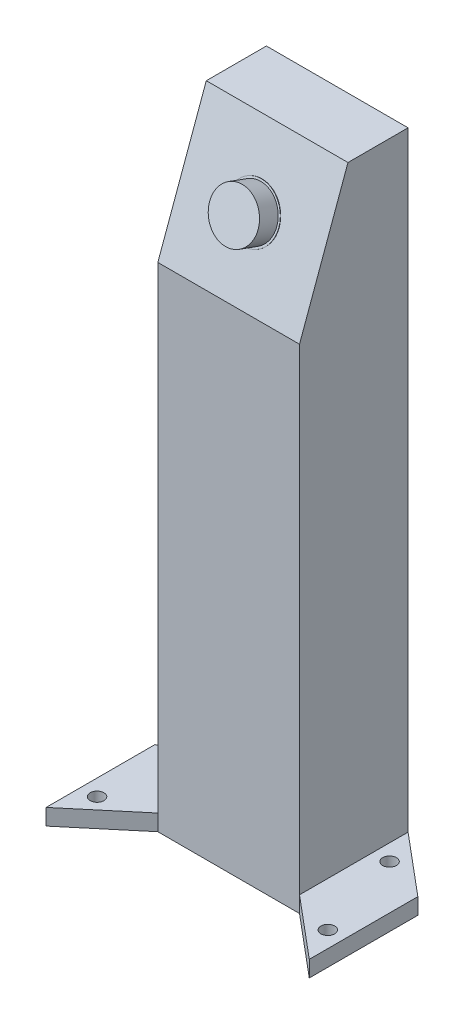
ISO-10303-21;
HEADER;
FILE_DESCRIPTION(('STEP AP214'),'2;1');
FILE_NAME('part.step','',(''),(''),'','','');
FILE_SCHEMA(('AUTOMOTIVE_DESIGN { 1 0 10303 214 1 1 1 1 }'));
ENDSEC;
DATA;
#1=APPLICATION_CONTEXT('core data for automotive mechanical design processes');
#2=APPLICATION_PROTOCOL_DEFINITION('international standard','automotive_design',2000,#1);
#3=PRODUCT_CONTEXT('',#1,'mechanical');
#4=PRODUCT('Part','Part','',(#3));
#5=PRODUCT_RELATED_PRODUCT_CATEGORY('part','',(#4));
#6=PRODUCT_DEFINITION_FORMATION('','',#4);
#7=PRODUCT_DEFINITION_CONTEXT('part definition',#1,'design');
#8=PRODUCT_DEFINITION('design','',#6,#7);
#9=PRODUCT_DEFINITION_SHAPE('','',#8);
#10=(LENGTH_UNIT() NAMED_UNIT(*) SI_UNIT(.MILLI.,.METRE.));
#11=(NAMED_UNIT(*) PLANE_ANGLE_UNIT() SI_UNIT($,.RADIAN.));
#12=(NAMED_UNIT(*) SI_UNIT($,.STERADIAN.) SOLID_ANGLE_UNIT());
#13=UNCERTAINTY_MEASURE_WITH_UNIT(LENGTH_MEASURE(1.E-05),#10,'distance_accuracy_value','');
#14=(GEOMETRIC_REPRESENTATION_CONTEXT(3) GLOBAL_UNCERTAINTY_ASSIGNED_CONTEXT((#13)) GLOBAL_UNIT_ASSIGNED_CONTEXT((#10,
#11,#12)) REPRESENTATION_CONTEXT('',''));
#15=CARTESIAN_POINT('',(0.,0.,0.));
#16=DIRECTION('',(0.,0.,1.));
#17=DIRECTION('',(1.,0.,0.));
#18=AXIS2_PLACEMENT_3D('',#15,#16,#17);
#19=CARTESIAN_POINT('',(35.,0.,0.));
#20=DIRECTION('',(1.,0.,0.));
#21=DIRECTION('',(0.,0.,-1.));
#22=AXIS2_PLACEMENT_3D('',#19,#20,#21);
#23=PLANE('',#22);
#24=DIRECTION('',(0.,-1.,0.));
#25=VECTOR('',#24,1.);
#26=CARTESIAN_POINT('',(35.,0.,0.));
#27=LINE('',#26,#25);
#28=CARTESIAN_POINT('',(35.,121.8,0.));
#29=VERTEX_POINT('',#28);
#30=CARTESIAN_POINT('',(35.,4.,0.));
#31=VERTEX_POINT('',#30);
#32=EDGE_CURVE('E200',#29,#31,#27,.T.);
#33=ORIENTED_EDGE('',*,*,#32,.T.);
#34=DIRECTION('',(0.,0.,-1.));
#35=VECTOR('',#34,1.);
#36=CARTESIAN_POINT('',(35.,4.,0.));
#37=LINE('',#36,#35);
#38=CARTESIAN_POINT('',(35.,4.,-26.82));
#39=VERTEX_POINT('',#38);
#40=EDGE_CURVE('E168',#31,#39,#37,.T.);
#41=ORIENTED_EDGE('',*,*,#40,.T.);
#42=DIRECTION('',(0.,1.,0.));
#43=VECTOR('',#42,1.);
#44=CARTESIAN_POINT('',(35.,0.,-26.82));
#45=LINE('',#44,#43);
#46=CARTESIAN_POINT('',(35.,154.689241727507,-26.82));
#47=VERTEX_POINT('',#46);
#48=EDGE_CURVE('E203',#39,#47,#45,.T.);
#49=ORIENTED_EDGE('',*,*,#48,.T.);
#50=DIRECTION('',(0.,0.,1.));
#51=VECTOR('',#50,1.);
#52=CARTESIAN_POINT('',(35.,154.689241727507,-26.82));
#53=LINE('',#52,#51);
#54=CARTESIAN_POINT('',(35.,154.689241727507,-11.9707050163983));
#55=VERTEX_POINT('',#54);
#56=EDGE_CURVE('E207',#47,#55,#53,.T.);
#57=ORIENTED_EDGE('',*,*,#56,.T.);
#58=DIRECTION('',(0.,-0.939692620785909,0.342020143325666));
#59=VECTOR('',#58,1.);
#60=CARTESIAN_POINT('',(35.,121.8,0.));
#61=LINE('',#60,#59);
#62=EDGE_CURVE('E209',#55,#29,#61,.T.);
#63=ORIENTED_EDGE('',*,*,#62,.T.);
#64=EDGE_LOOP('',(#33,#41,#49,#57,#63));
#65=FACE_BOUND('',#64,.T.);
#66=ADVANCED_FACE('F35',(#65),#23,.T.);
#67=CARTESIAN_POINT('',(35.,0.,0.));
#68=DIRECTION('',(0.,0.,-1.));
#69=DIRECTION('',(-1.,0.,0.));
#70=AXIS2_PLACEMENT_3D('',#67,#68,#69);
#71=PLANE('',#70);
#72=DIRECTION('',(0.,-1.,0.));
#73=VECTOR('',#72,1.);
#74=CARTESIAN_POINT('',(0.,0.,0.));
#75=LINE('',#74,#73);
#76=CARTESIAN_POINT('',(0.,121.8,0.));
#77=VERTEX_POINT('',#76);
#78=CARTESIAN_POINT('',(0.,4.,0.));
#79=VERTEX_POINT('',#78);
#80=EDGE_CURVE('E199',#77,#79,#75,.T.);
#81=ORIENTED_EDGE('',*,*,#80,.T.);
#82=DIRECTION('',(0.,-1.,0.));
#83=VECTOR('',#82,1.);
#84=CARTESIAN_POINT('',(0.,4.,0.));
#85=LINE('',#84,#83);
#86=CARTESIAN_POINT('',(0.,0.,0.));
#87=VERTEX_POINT('',#86);
#88=EDGE_CURVE('E137',#79,#87,#85,.T.);
#89=ORIENTED_EDGE('',*,*,#88,.T.);
#90=DIRECTION('',(-1.,0.,0.));
#91=VECTOR('',#90,1.);
#92=CARTESIAN_POINT('',(35.,0.,0.));
#93=LINE('',#92,#91);
#94=CARTESIAN_POINT('',(35.,0.,0.));
#95=VERTEX_POINT('',#94);
#96=EDGE_CURVE('E43',#95,#87,#93,.T.);
#97=ORIENTED_EDGE('',*,*,#96,.F.);
#98=DIRECTION('',(0.,-1.,0.));
#99=VECTOR('',#98,1.);
#100=CARTESIAN_POINT('',(35.,4.,0.));
#101=LINE('',#100,#99);
#102=EDGE_CURVE('E187',#31,#95,#101,.T.);
#103=ORIENTED_EDGE('',*,*,#102,.F.);
#104=ORIENTED_EDGE('',*,*,#32,.F.);
#105=DIRECTION('',(-1.,0.,0.));
#106=VECTOR('',#105,1.);
#107=CARTESIAN_POINT('',(35.,121.8,0.));
#108=LINE('',#107,#106);
#109=EDGE_CURVE('E211',#29,#77,#108,.T.);
#110=ORIENTED_EDGE('',*,*,#109,.T.);
#111=EDGE_LOOP('',(#81,#89,#97,#103,#104,#110));
#112=FACE_BOUND('',#111,.T.);
#113=ADVANCED_FACE('F37',(#112),#71,.F.);
#114=CARTESIAN_POINT('',(35.,0.,-11.9707050163983));
#115=DIRECTION('',(0.,1.,0.));
#116=DIRECTION('',(0.,0.,1.));
#117=AXIS2_PLACEMENT_3D('',#114,#115,#116);
#118=PLANE('',#117);
#119=ORIENTED_EDGE('',*,*,#96,.T.);
#120=DIRECTION('',(-0.766044443118982,0.,0.642787609686535));
#121=VECTOR('',#120,1.);
#122=CARTESIAN_POINT('',(-15.,0.,12.5864944676591));
#123=LINE('',#122,#121);
#124=CARTESIAN_POINT('',(-15.,0.,12.5864944676591));
#125=VERTEX_POINT('',#124);
#126=EDGE_CURVE('E149',#87,#125,#123,.T.);
#127=ORIENTED_EDGE('',*,*,#126,.T.);
#128=DIRECTION('',(0.,0.,-1.));
#129=VECTOR('',#128,1.);
#130=CARTESIAN_POINT('',(-15.,0.,-14.2335055323409));
#131=LINE('',#130,#129);
#132=CARTESIAN_POINT('',(-15.,0.,-14.2335055323409));
#133=VERTEX_POINT('',#132);
#134=EDGE_CURVE('E125',#125,#133,#131,.T.);
#135=ORIENTED_EDGE('',*,*,#134,.T.);
#136=DIRECTION('',(0.766044443118982,0.,-0.642787609686535));
#137=VECTOR('',#136,1.);
#138=CARTESIAN_POINT('',(0.,0.,-26.82));
#139=LINE('',#138,#137);
#140=CARTESIAN_POINT('',(0.,0.,-26.82));
#141=VERTEX_POINT('',#140);
#142=EDGE_CURVE('E139',#133,#141,#139,.T.);
#143=ORIENTED_EDGE('',*,*,#142,.T.);
#144=DIRECTION('',(-1.,0.,0.));
#145=VECTOR('',#144,1.);
#146=CARTESIAN_POINT('',(35.,0.,-26.82));
#147=LINE('',#146,#145);
#148=CARTESIAN_POINT('',(35.,0.,-26.82));
#149=VERTEX_POINT('',#148);
#150=EDGE_CURVE('E229',#149,#141,#147,.T.);
#151=ORIENTED_EDGE('',*,*,#150,.F.);
#152=DIRECTION('',(0.766044443118982,0.,0.642787609686535));
#153=VECTOR('',#152,1.);
#154=CARTESIAN_POINT('',(35.,0.,-26.82));
#155=LINE('',#154,#153);
#156=CARTESIAN_POINT('',(50.,0.,-14.2335055323409));
#157=VERTEX_POINT('',#156);
#158=EDGE_CURVE('E165',#149,#157,#155,.T.);
#159=ORIENTED_EDGE('',*,*,#158,.T.);
#160=DIRECTION('',(0.,0.,1.));
#161=VECTOR('',#160,1.);
#162=CARTESIAN_POINT('',(50.,0.,-14.2335055323409));
#163=LINE('',#162,#161);
#164=CARTESIAN_POINT('',(50.,0.,12.5864944676591));
#165=VERTEX_POINT('',#164);
#166=EDGE_CURVE('E182',#157,#165,#163,.T.);
#167=ORIENTED_EDGE('',*,*,#166,.T.);
#168=DIRECTION('',(-0.766044443118982,0.,-0.642787609686535));
#169=VECTOR('',#168,1.);
#170=CARTESIAN_POINT('',(50.,0.,12.5864944676591));
#171=LINE('',#170,#169);
#172=EDGE_CURVE('E171',#165,#95,#171,.T.);
#173=ORIENTED_EDGE('',*,*,#172,.T.);
#174=EDGE_LOOP('',(#119,#127,#135,#143,#151,#159,#167,#173));
#175=FACE_BOUND('',#174,.T.);
#176=CARTESIAN_POINT('',(39.,0.,-18.2419723179618));
#177=DIRECTION('',(0.,-1.,0.));
#178=DIRECTION('',(0.,0.,-1.));
#179=AXIS2_PLACEMENT_3D('',#176,#177,#178);
#180=CIRCLE('',#179,1.7);
#181=CARTESIAN_POINT('',(39.,0.,-19.9419723179618));
#182=VERTEX_POINT('',#181);
#183=EDGE_CURVE('E154',#182,#182,#180,.T.);
#184=ORIENTED_EDGE('',*,*,#183,.F.);
#185=EDGE_LOOP('',(#184));
#186=FACE_BOUND('',#185,.T.);
#187=CARTESIAN_POINT('',(46.,0.,4.00846678562087));
#188=DIRECTION('',(0.,-1.,0.));
#189=DIRECTION('',(0.,0.,-1.));
#190=AXIS2_PLACEMENT_3D('',#187,#188,#189);
#191=CIRCLE('',#190,1.7);
#192=CARTESIAN_POINT('',(46.,0.,2.30846678562087));
#193=VERTEX_POINT('',#192);
#194=EDGE_CURVE('E159',#193,#193,#191,.T.);
#195=ORIENTED_EDGE('',*,*,#194,.F.);
#196=EDGE_LOOP('',(#195));
#197=FACE_BOUND('',#196,.T.);
#198=CARTESIAN_POINT('',(-11.,0.,4.00846678562087));
#199=DIRECTION('',(0.,-1.,0.));
#200=DIRECTION('',(0.,0.,1.));
#201=AXIS2_PLACEMENT_3D('',#198,#199,#200);
#202=CIRCLE('',#201,1.7);
#203=CARTESIAN_POINT('',(-11.,0.,5.70846678562087));
#204=VERTEX_POINT('',#203);
#205=EDGE_CURVE('E459',#204,#204,#202,.T.);
#206=ORIENTED_EDGE('',*,*,#205,.F.);
#207=EDGE_LOOP('',(#206));
#208=FACE_BOUND('',#207,.T.);
#209=CARTESIAN_POINT('',(-4.,0.,-18.2419723179618));
#210=DIRECTION('',(0.,-1.,0.));
#211=DIRECTION('',(0.,0.,1.));
#212=AXIS2_PLACEMENT_3D('',#209,#210,#211);
#213=CIRCLE('',#212,1.7);
#214=CARTESIAN_POINT('',(-4.,0.,-16.5419723179618));
#215=VERTEX_POINT('',#214);
#216=EDGE_CURVE('E144',#215,#215,#213,.T.);
#217=ORIENTED_EDGE('',*,*,#216,.F.);
#218=EDGE_LOOP('',(#217));
#219=FACE_BOUND('',#218,.T.);
#220=ADVANCED_FACE('F278',(#175,#186,#197,#208,#219),#118,.F.);
#221=CARTESIAN_POINT('',(35.,0.,-26.82));
#222=DIRECTION('',(0.,0.,1.));
#223=DIRECTION('',(1.,0.,0.));
#224=AXIS2_PLACEMENT_3D('',#221,#222,#223);
#225=PLANE('',#224);
#226=DIRECTION('',(0.,1.,0.));
#227=VECTOR('',#226,1.);
#228=CARTESIAN_POINT('',(0.,0.,-26.82));
#229=LINE('',#228,#227);
#230=CARTESIAN_POINT('',(0.,4.,-26.82));
#231=VERTEX_POINT('',#230);
#232=EDGE_CURVE('E215',#141,#231,#229,.T.);
#233=ORIENTED_EDGE('',*,*,#232,.T.);
#234=CARTESIAN_POINT('',(0.,154.689241727507,-26.82));
#235=VERTEX_POINT('',#234);
#236=EDGE_CURVE('E214',#231,#235,#229,.T.);
#237=ORIENTED_EDGE('',*,*,#236,.T.);
#238=DIRECTION('',(-1.,0.,0.));
#239=VECTOR('',#238,1.);
#240=CARTESIAN_POINT('',(35.,154.689241727507,-26.82));
#241=LINE('',#240,#239);
#242=EDGE_CURVE('E226',#47,#235,#241,.T.);
#243=ORIENTED_EDGE('',*,*,#242,.F.);
#244=ORIENTED_EDGE('',*,*,#48,.F.);
#245=EDGE_CURVE('E205',#149,#39,#45,.T.);
#246=ORIENTED_EDGE('',*,*,#245,.F.);
#247=ORIENTED_EDGE('',*,*,#150,.T.);
#248=EDGE_LOOP('',(#233,#237,#243,#244,#246,#247));
#249=FACE_BOUND('',#248,.T.);
#250=ADVANCED_FACE('F271',(#249),#225,.F.);
#251=CARTESIAN_POINT('',(35.,154.689241727507,-26.82));
#252=DIRECTION('',(0.,-1.,0.));
#253=DIRECTION('',(0.,0.,-1.));
#254=AXIS2_PLACEMENT_3D('',#251,#252,#253);
#255=PLANE('',#254);
#256=DIRECTION('',(0.,0.,1.));
#257=VECTOR('',#256,1.);
#258=CARTESIAN_POINT('',(0.,154.689241727507,-26.82));
#259=LINE('',#258,#257);
#260=CARTESIAN_POINT('',(0.,154.689241727507,-11.9707050163983));
#261=VERTEX_POINT('',#260);
#262=EDGE_CURVE('E218',#235,#261,#259,.T.);
#263=ORIENTED_EDGE('',*,*,#262,.T.);
#264=DIRECTION('',(-1.,0.,0.));
#265=VECTOR('',#264,1.);
#266=CARTESIAN_POINT('',(35.,154.689241727507,-11.9707050163983));
#267=LINE('',#266,#265);
#268=EDGE_CURVE('E223',#55,#261,#267,.T.);
#269=ORIENTED_EDGE('',*,*,#268,.F.);
#270=ORIENTED_EDGE('',*,*,#56,.F.);
#271=ORIENTED_EDGE('',*,*,#242,.T.);
#272=EDGE_LOOP('',(#263,#269,#270,#271));
#273=FACE_BOUND('',#272,.T.);
#274=ADVANCED_FACE('F256',(#273),#255,.F.);
#275=CARTESIAN_POINT('',(35.,121.8,0.));
#276=DIRECTION('',(0.,-0.342020143325666,-0.93969262078591));
#277=DIRECTION('',(0.,0.93969262078591,-0.342020143325666));
#278=AXIS2_PLACEMENT_3D('',#275,#276,#277);
#279=PLANE('',#278);
#280=CARTESIAN_POINT('',(17.5,138.244620863753,-5.98535250819917));
#281=DIRECTION('',(0.,-0.342020143325666,-0.93969262078591));
#282=DIRECTION('',(0.,0.93969262078591,-0.342020143325666));
#283=AXIS2_PLACEMENT_3D('',#280,#281,#282);
#284=CIRCLE('',#283,6.50000000000001);
#285=CARTESIAN_POINT('',(17.5,144.352622898862,-8.208483439816));
#286=VERTEX_POINT('',#285);
#287=EDGE_CURVE('E11',#286,#286,#284,.F.);
#288=ORIENTED_EDGE('',*,*,#287,.F.);
#289=EDGE_LOOP('',(#288));
#290=FACE_BOUND('',#289,.T.);
#291=DIRECTION('',(0.,-0.939692620785909,0.342020143325666));
#292=VECTOR('',#291,1.);
#293=CARTESIAN_POINT('',(0.,121.8,0.));
#294=LINE('',#293,#292);
#295=EDGE_CURVE('E204',#261,#77,#294,.T.);
#296=ORIENTED_EDGE('',*,*,#295,.T.);
#297=ORIENTED_EDGE('',*,*,#109,.F.);
#298=ORIENTED_EDGE('',*,*,#62,.F.);
#299=ORIENTED_EDGE('',*,*,#268,.T.);
#300=EDGE_LOOP('',(#296,#297,#298,#299));
#301=FACE_BOUND('',#300,.T.);
#302=ADVANCED_FACE('F253',(#290,#301),#279,.F.);
#303=CARTESIAN_POINT('',(0.,0.,0.));
#304=DIRECTION('',(1.,0.,0.));
#305=DIRECTION('',(0.,0.,-1.));
#306=AXIS2_PLACEMENT_3D('',#303,#304,#305);
#307=PLANE('',#306);
#308=ORIENTED_EDGE('',*,*,#236,.F.);
#309=DIRECTION('',(0.,0.,1.));
#310=VECTOR('',#309,1.);
#311=CARTESIAN_POINT('',(0.,4.,0.));
#312=LINE('',#311,#310);
#313=EDGE_CURVE('E129',#231,#79,#312,.T.);
#314=ORIENTED_EDGE('',*,*,#313,.T.);
#315=ORIENTED_EDGE('',*,*,#80,.F.);
#316=ORIENTED_EDGE('',*,*,#295,.F.);
#317=ORIENTED_EDGE('',*,*,#262,.F.);
#318=EDGE_LOOP('',(#308,#314,#315,#316,#317));
#319=FACE_BOUND('',#318,.T.);
#320=ADVANCED_FACE('F249',(#319),#307,.F.);
#321=CARTESIAN_POINT('',(17.5,138.278822878086,-5.89138324612054));
#322=DIRECTION('',(0.,-0.342020143325666,-0.939692620785909));
#323=DIRECTION('',(0.,0.93969262078591,-0.342020143325666));
#324=AXIS2_PLACEMENT_3D('',#321,#322,#323);
#325=CYLINDRICAL_SURFACE('',#324,6.50000000000001);
#326=CARTESIAN_POINT('',(17.5,138.278822878086,-5.89138324612054));
#327=DIRECTION('',(0.,0.342020143325666,0.93969262078591));
#328=DIRECTION('',(0.,-0.93969262078591,0.342020143325666));
#329=AXIS2_PLACEMENT_3D('',#326,#327,#328);
#330=CIRCLE('',#329,6.50000000000001);
#331=CARTESIAN_POINT('',(17.5,132.170820842978,-3.66825231450371));
#332=VERTEX_POINT('',#331);
#333=EDGE_CURVE('E189',#332,#332,#330,.T.);
#334=ORIENTED_EDGE('',*,*,#333,.F.);
#335=EDGE_LOOP('',(#334));
#336=FACE_BOUND('',#335,.T.);
#337=ORIENTED_EDGE('',*,*,#287,.T.);
#338=EDGE_LOOP('',(#337));
#339=FACE_BOUND('',#338,.T.);
#340=ADVANCED_FACE('F243',(#336,#339),#325,.T.);
#341=CARTESIAN_POINT('',(17.5,138.278822878086,-5.89138324612054));
#342=DIRECTION('',(0.,0.342020143325666,0.93969262078591));
#343=DIRECTION('',(0.,-0.93969262078591,0.342020143325666));
#344=AXIS2_PLACEMENT_3D('',#341,#342,#343);
#345=PLANE('',#344);
#346=CARTESIAN_POINT('',(17.5,138.278822878086,-5.89138324612053));
#347=DIRECTION('',(0.,0.342020143325666,0.93969262078591));
#348=DIRECTION('',(0.,-0.93969262078591,0.342020143325666));
#349=AXIS2_PLACEMENT_3D('',#346,#347,#348);
#350=CIRCLE('',#349,6.00000000000001);
#351=CARTESIAN_POINT('',(17.5,132.640667153371,-3.83926238616653));
#352=VERTEX_POINT('',#351);
#353=EDGE_CURVE('E195',#352,#352,#350,.T.);
#354=ORIENTED_EDGE('',*,*,#353,.F.);
#355=EDGE_LOOP('',(#354));
#356=FACE_BOUND('',#355,.T.);
#357=ORIENTED_EDGE('',*,*,#333,.T.);
#358=EDGE_LOOP('',(#357));
#359=FACE_BOUND('',#358,.T.);
#360=ADVANCED_FACE('F239',(#356,#359),#345,.T.);
#361=CARTESIAN_POINT('',(17.5,139.954721580382,-1.28688940426957));
#362=DIRECTION('',(0.,0.342020143325666,0.93969262078591));
#363=DIRECTION('',(0.,-0.93969262078591,0.342020143325666));
#364=AXIS2_PLACEMENT_3D('',#361,#362,#363);
#365=PLANE('',#364);
#366=CARTESIAN_POINT('',(17.5,139.954721580382,-1.28688940426957));
#367=DIRECTION('',(0.,0.342020143325666,0.93969262078591));
#368=DIRECTION('',(0.,-0.93969262078591,0.342020143325666));
#369=AXIS2_PLACEMENT_3D('',#366,#367,#368);
#370=CIRCLE('',#369,6.00000000000001);
#371=CARTESIAN_POINT('',(17.5,134.316565855666,0.765231455684423));
#372=VERTEX_POINT('',#371);
#373=EDGE_CURVE('E196',#372,#372,#370,.T.);
#374=ORIENTED_EDGE('',*,*,#373,.T.);
#375=EDGE_LOOP('',(#374));
#376=FACE_BOUND('',#375,.T.);
#377=ADVANCED_FACE('F242',(#376),#365,.T.);
#378=CARTESIAN_POINT('',(17.5,139.954721580382,-1.28688940426957));
#379=DIRECTION('',(0.,-0.342020143325666,-0.93969262078591));
#380=DIRECTION('',(0.,0.93969262078591,-0.342020143325666));
#381=AXIS2_PLACEMENT_3D('',#378,#379,#380);
#382=CYLINDRICAL_SURFACE('',#381,6.00000000000001);
#383=ORIENTED_EDGE('',*,*,#353,.T.);
#384=EDGE_LOOP('',(#383));
#385=FACE_BOUND('',#384,.T.);
#386=ORIENTED_EDGE('',*,*,#373,.F.);
#387=EDGE_LOOP('',(#386));
#388=FACE_BOUND('',#387,.T.);
#389=ADVANCED_FACE('F236',(#385,#388),#382,.T.);
#390=CARTESIAN_POINT('',(50.,4.,12.5864944676591));
#391=DIRECTION('',(-0.642787609686535,0.,0.766044443118982));
#392=DIRECTION('',(0.766044443118982,0.,0.642787609686535));
#393=AXIS2_PLACEMENT_3D('',#390,#391,#392);
#394=PLANE('',#393);
#395=ORIENTED_EDGE('',*,*,#172,.F.);
#396=DIRECTION('',(0.,-1.,0.));
#397=VECTOR('',#396,1.);
#398=CARTESIAN_POINT('',(50.,4.,12.5864944676591));
#399=LINE('',#398,#397);
#400=CARTESIAN_POINT('',(50.,4.,12.5864944676591));
#401=VERTEX_POINT('',#400);
#402=EDGE_CURVE('E190',#401,#165,#399,.T.);
#403=ORIENTED_EDGE('',*,*,#402,.F.);
#404=DIRECTION('',(-0.766044443118982,0.,-0.642787609686535));
#405=VECTOR('',#404,1.);
#406=CARTESIAN_POINT('',(50.,4.,12.5864944676591));
#407=LINE('',#406,#405);
#408=EDGE_CURVE('E176',#401,#31,#407,.T.);
#409=ORIENTED_EDGE('',*,*,#408,.T.);
#410=ORIENTED_EDGE('',*,*,#102,.T.);
#411=EDGE_LOOP('',(#395,#403,#409,#410));
#412=FACE_BOUND('',#411,.T.);
#413=ADVANCED_FACE('F291',(#412),#394,.T.);
#414=CARTESIAN_POINT('',(50.,4.,-14.2335055323409));
#415=DIRECTION('',(1.,0.,0.));
#416=DIRECTION('',(0.,0.,-1.));
#417=AXIS2_PLACEMENT_3D('',#414,#415,#416);
#418=PLANE('',#417);
#419=ORIENTED_EDGE('',*,*,#166,.F.);
#420=DIRECTION('',(0.,-1.,0.));
#421=VECTOR('',#420,1.);
#422=CARTESIAN_POINT('',(50.,4.,-14.2335055323409));
#423=LINE('',#422,#421);
#424=CARTESIAN_POINT('',(50.,4.,-14.2335055323409));
#425=VERTEX_POINT('',#424);
#426=EDGE_CURVE('E179',#425,#157,#423,.T.);
#427=ORIENTED_EDGE('',*,*,#426,.F.);
#428=DIRECTION('',(0.,0.,1.));
#429=VECTOR('',#428,1.);
#430=CARTESIAN_POINT('',(50.,4.,-14.2335055323409));
#431=LINE('',#430,#429);
#432=EDGE_CURVE('E173',#425,#401,#431,.T.);
#433=ORIENTED_EDGE('',*,*,#432,.T.);
#434=ORIENTED_EDGE('',*,*,#402,.T.);
#435=EDGE_LOOP('',(#419,#427,#433,#434));
#436=FACE_BOUND('',#435,.T.);
#437=ADVANCED_FACE('F293',(#436),#418,.T.);
#438=CARTESIAN_POINT('',(35.,4.,-26.82));
#439=DIRECTION('',(0.642787609686535,0.,-0.766044443118982));
#440=DIRECTION('',(-0.766044443118982,0.,-0.642787609686535));
#441=AXIS2_PLACEMENT_3D('',#438,#439,#440);
#442=PLANE('',#441);
#443=ORIENTED_EDGE('',*,*,#158,.F.);
#444=ORIENTED_EDGE('',*,*,#245,.T.);
#445=DIRECTION('',(0.766044443118982,0.,0.642787609686535));
#446=VECTOR('',#445,1.);
#447=CARTESIAN_POINT('',(35.,4.,-26.82));
#448=LINE('',#447,#446);
#449=EDGE_CURVE('E58',#39,#425,#448,.T.);
#450=ORIENTED_EDGE('',*,*,#449,.T.);
#451=ORIENTED_EDGE('',*,*,#426,.T.);
#452=EDGE_LOOP('',(#443,#444,#450,#451));
#453=FACE_BOUND('',#452,.T.);
#454=ADVANCED_FACE('F288',(#453),#442,.T.);
#455=CARTESIAN_POINT('',(0.,4.,0.));
#456=DIRECTION('',(0.,-1.,0.));
#457=DIRECTION('',(0.,0.,-1.));
#458=AXIS2_PLACEMENT_3D('',#455,#456,#457);
#459=PLANE('',#458);
#460=CARTESIAN_POINT('',(39.,4.,-18.2419723179618));
#461=DIRECTION('',(0.,-1.,0.));
#462=DIRECTION('',(0.,0.,-1.));
#463=AXIS2_PLACEMENT_3D('',#460,#461,#462);
#464=CIRCLE('',#463,1.7);
#465=CARTESIAN_POINT('',(39.,4.,-19.9419723179618));
#466=VERTEX_POINT('',#465);
#467=EDGE_CURVE('E156',#466,#466,#464,.T.);
#468=ORIENTED_EDGE('',*,*,#467,.T.);
#469=EDGE_LOOP('',(#468));
#470=FACE_BOUND('',#469,.T.);
#471=CARTESIAN_POINT('',(46.,4.,4.00846678562087));
#472=DIRECTION('',(0.,-1.,0.));
#473=DIRECTION('',(0.,0.,-1.));
#474=AXIS2_PLACEMENT_3D('',#471,#472,#473);
#475=CIRCLE('',#474,1.7);
#476=CARTESIAN_POINT('',(46.,4.,2.30846678562087));
#477=VERTEX_POINT('',#476);
#478=EDGE_CURVE('E162',#477,#477,#475,.T.);
#479=ORIENTED_EDGE('',*,*,#478,.T.);
#480=EDGE_LOOP('',(#479));
#481=FACE_BOUND('',#480,.T.);
#482=ORIENTED_EDGE('',*,*,#40,.F.);
#483=ORIENTED_EDGE('',*,*,#408,.F.);
#484=ORIENTED_EDGE('',*,*,#432,.F.);
#485=ORIENTED_EDGE('',*,*,#449,.F.);
#486=EDGE_LOOP('',(#482,#483,#484,#485));
#487=FACE_BOUND('',#486,.T.);
#488=ADVANCED_FACE('F294',(#470,#481,#487),#459,.F.);
#489=CARTESIAN_POINT('',(46.,4.,4.00846678562087));
#490=DIRECTION('',(0.,-1.,0.));
#491=DIRECTION('',(0.,0.,-1.));
#492=AXIS2_PLACEMENT_3D('',#489,#490,#491);
#493=CYLINDRICAL_SURFACE('',#492,1.7);
#494=ORIENTED_EDGE('',*,*,#478,.F.);
#495=EDGE_LOOP('',(#494));
#496=FACE_BOUND('',#495,.T.);
#497=ORIENTED_EDGE('',*,*,#194,.T.);
#498=EDGE_LOOP('',(#497));
#499=FACE_BOUND('',#498,.T.);
#500=ADVANCED_FACE('F296',(#496,#499),#493,.F.);
#501=CARTESIAN_POINT('',(39.,4.,-18.2419723179618));
#502=DIRECTION('',(0.,-1.,0.));
#503=DIRECTION('',(0.,0.,-1.));
#504=AXIS2_PLACEMENT_3D('',#501,#502,#503);
#505=CYLINDRICAL_SURFACE('',#504,1.7);
#506=ORIENTED_EDGE('',*,*,#467,.F.);
#507=EDGE_LOOP('',(#506));
#508=FACE_BOUND('',#507,.T.);
#509=ORIENTED_EDGE('',*,*,#183,.T.);
#510=EDGE_LOOP('',(#509));
#511=FACE_BOUND('',#510,.T.);
#512=ADVANCED_FACE('F303',(#508,#511),#505,.F.);
#513=CARTESIAN_POINT('',(-15.,4.,12.5864944676591));
#514=DIRECTION('',(0.642787609686535,0.,0.766044443118982));
#515=DIRECTION('',(0.766044443118982,0.,-0.642787609686535));
#516=AXIS2_PLACEMENT_3D('',#513,#514,#515);
#517=PLANE('',#516);
#518=ORIENTED_EDGE('',*,*,#126,.F.);
#519=ORIENTED_EDGE('',*,*,#88,.F.);
#520=DIRECTION('',(-0.766044443118982,0.,0.642787609686535));
#521=VECTOR('',#520,1.);
#522=CARTESIAN_POINT('',(-15.,4.,12.5864944676591));
#523=LINE('',#522,#521);
#524=CARTESIAN_POINT('',(-15.,4.,12.5864944676591));
#525=VERTEX_POINT('',#524);
#526=EDGE_CURVE('E50',#79,#525,#523,.T.);
#527=ORIENTED_EDGE('',*,*,#526,.T.);
#528=DIRECTION('',(0.,-1.,0.));
#529=VECTOR('',#528,1.);
#530=CARTESIAN_POINT('',(-15.,4.,12.5864944676591));
#531=LINE('',#530,#529);
#532=EDGE_CURVE('E121',#525,#125,#531,.T.);
#533=ORIENTED_EDGE('',*,*,#532,.T.);
#534=EDGE_LOOP('',(#518,#519,#527,#533));
#535=FACE_BOUND('',#534,.T.);
#536=ADVANCED_FACE('F135',(#535),#517,.T.);
#537=CARTESIAN_POINT('',(0.,4.,-26.82));
#538=DIRECTION('',(-0.642787609686535,0.,-0.766044443118982));
#539=DIRECTION('',(-0.766044443118982,0.,0.642787609686535));
#540=AXIS2_PLACEMENT_3D('',#537,#538,#539);
#541=PLANE('',#540);
#542=ORIENTED_EDGE('',*,*,#142,.F.);
#543=DIRECTION('',(0.,-1.,0.));
#544=VECTOR('',#543,1.);
#545=CARTESIAN_POINT('',(-15.,4.,-14.2335055323409));
#546=LINE('',#545,#544);
#547=CARTESIAN_POINT('',(-15.,4.,-14.2335055323409));
#548=VERTEX_POINT('',#547);
#549=EDGE_CURVE('E128',#548,#133,#546,.T.);
#550=ORIENTED_EDGE('',*,*,#549,.F.);
#551=DIRECTION('',(0.766044443118982,0.,-0.642787609686535));
#552=VECTOR('',#551,1.);
#553=CARTESIAN_POINT('',(0.,4.,-26.82));
#554=LINE('',#553,#552);
#555=EDGE_CURVE('E133',#548,#231,#554,.T.);
#556=ORIENTED_EDGE('',*,*,#555,.T.);
#557=ORIENTED_EDGE('',*,*,#232,.F.);
#558=EDGE_LOOP('',(#542,#550,#556,#557));
#559=FACE_BOUND('',#558,.T.);
#560=ADVANCED_FACE('F276',(#559),#541,.T.);
#561=CARTESIAN_POINT('',(-15.,4.,-14.2335055323409));
#562=DIRECTION('',(-1.,0.,0.));
#563=DIRECTION('',(0.,0.,1.));
#564=AXIS2_PLACEMENT_3D('',#561,#562,#563);
#565=PLANE('',#564);
#566=ORIENTED_EDGE('',*,*,#134,.F.);
#567=ORIENTED_EDGE('',*,*,#532,.F.);
#568=DIRECTION('',(0.,0.,-1.));
#569=VECTOR('',#568,1.);
#570=CARTESIAN_POINT('',(-15.,4.,-14.2335055323409));
#571=LINE('',#570,#569);
#572=EDGE_CURVE('E123',#525,#548,#571,.T.);
#573=ORIENTED_EDGE('',*,*,#572,.T.);
#574=ORIENTED_EDGE('',*,*,#549,.T.);
#575=EDGE_LOOP('',(#566,#567,#573,#574));
#576=FACE_BOUND('',#575,.T.);
#577=ADVANCED_FACE('F122',(#576),#565,.T.);
#578=CARTESIAN_POINT('',(0.,4.,0.));
#579=DIRECTION('',(0.,1.,0.));
#580=DIRECTION('',(0.,0.,1.));
#581=AXIS2_PLACEMENT_3D('',#578,#579,#580);
#582=PLANE('',#581);
#583=CARTESIAN_POINT('',(-11.,4.,4.00846678562087));
#584=DIRECTION('',(0.,-1.,0.));
#585=DIRECTION('',(0.,0.,1.));
#586=AXIS2_PLACEMENT_3D('',#583,#584,#585);
#587=CIRCLE('',#586,1.7);
#588=CARTESIAN_POINT('',(-11.,4.,5.70846678562087));
#589=VERTEX_POINT('',#588);
#590=EDGE_CURVE('E456',#589,#589,#587,.T.);
#591=ORIENTED_EDGE('',*,*,#590,.T.);
#592=EDGE_LOOP('',(#591));
#593=FACE_BOUND('',#592,.T.);
#594=CARTESIAN_POINT('',(-4.,4.,-18.2419723179618));
#595=DIRECTION('',(0.,-1.,0.));
#596=DIRECTION('',(0.,0.,1.));
#597=AXIS2_PLACEMENT_3D('',#594,#595,#596);
#598=CIRCLE('',#597,1.7);
#599=CARTESIAN_POINT('',(-4.,4.,-16.5419723179618));
#600=VERTEX_POINT('',#599);
#601=EDGE_CURVE('E151',#600,#600,#598,.T.);
#602=ORIENTED_EDGE('',*,*,#601,.T.);
#603=EDGE_LOOP('',(#602));
#604=FACE_BOUND('',#603,.T.);
#605=ORIENTED_EDGE('',*,*,#526,.F.);
#606=ORIENTED_EDGE('',*,*,#313,.F.);
#607=ORIENTED_EDGE('',*,*,#555,.F.);
#608=ORIENTED_EDGE('',*,*,#572,.F.);
#609=EDGE_LOOP('',(#605,#606,#607,#608));
#610=FACE_BOUND('',#609,.T.);
#611=ADVANCED_FACE('F132',(#593,#604,#610),#582,.T.);
#612=CARTESIAN_POINT('',(-4.,4.,-18.2419723179618));
#613=DIRECTION('',(0.,-1.,0.));
#614=DIRECTION('',(0.,0.,-1.));
#615=AXIS2_PLACEMENT_3D('',#612,#613,#614);
#616=CYLINDRICAL_SURFACE('',#615,1.7);
#617=ORIENTED_EDGE('',*,*,#601,.F.);
#618=EDGE_LOOP('',(#617));
#619=FACE_BOUND('',#618,.T.);
#620=ORIENTED_EDGE('',*,*,#216,.T.);
#621=EDGE_LOOP('',(#620));
#622=FACE_BOUND('',#621,.T.);
#623=ADVANCED_FACE('F429',(#619,#622),#616,.F.);
#624=CARTESIAN_POINT('',(-11.,4.,4.00846678562087));
#625=DIRECTION('',(0.,-1.,0.));
#626=DIRECTION('',(0.,0.,-1.));
#627=AXIS2_PLACEMENT_3D('',#624,#625,#626);
#628=CYLINDRICAL_SURFACE('',#627,1.7);
#629=ORIENTED_EDGE('',*,*,#590,.F.);
#630=EDGE_LOOP('',(#629));
#631=FACE_BOUND('',#630,.T.);
#632=ORIENTED_EDGE('',*,*,#205,.T.);
#633=EDGE_LOOP('',(#632));
#634=FACE_BOUND('',#633,.T.);
#635=ADVANCED_FACE('F439',(#631,#634),#628,.F.);
#636=CLOSED_SHELL('',(#66,#113,#220,#250,#274,#302,#320,#340,#360,#377,#389,#413,#437,#454,#488,
#500,#512,#536,#560,#577,#611,#623,#635));
#637=MANIFOLD_SOLID_BREP('B2',#636);
#638=ADVANCED_BREP_SHAPE_REPRESENTATION('',(#18,#637),#14);
#639=SHAPE_DEFINITION_REPRESENTATION(#9,#638);
ENDSEC;
END-ISO-10303-21;
